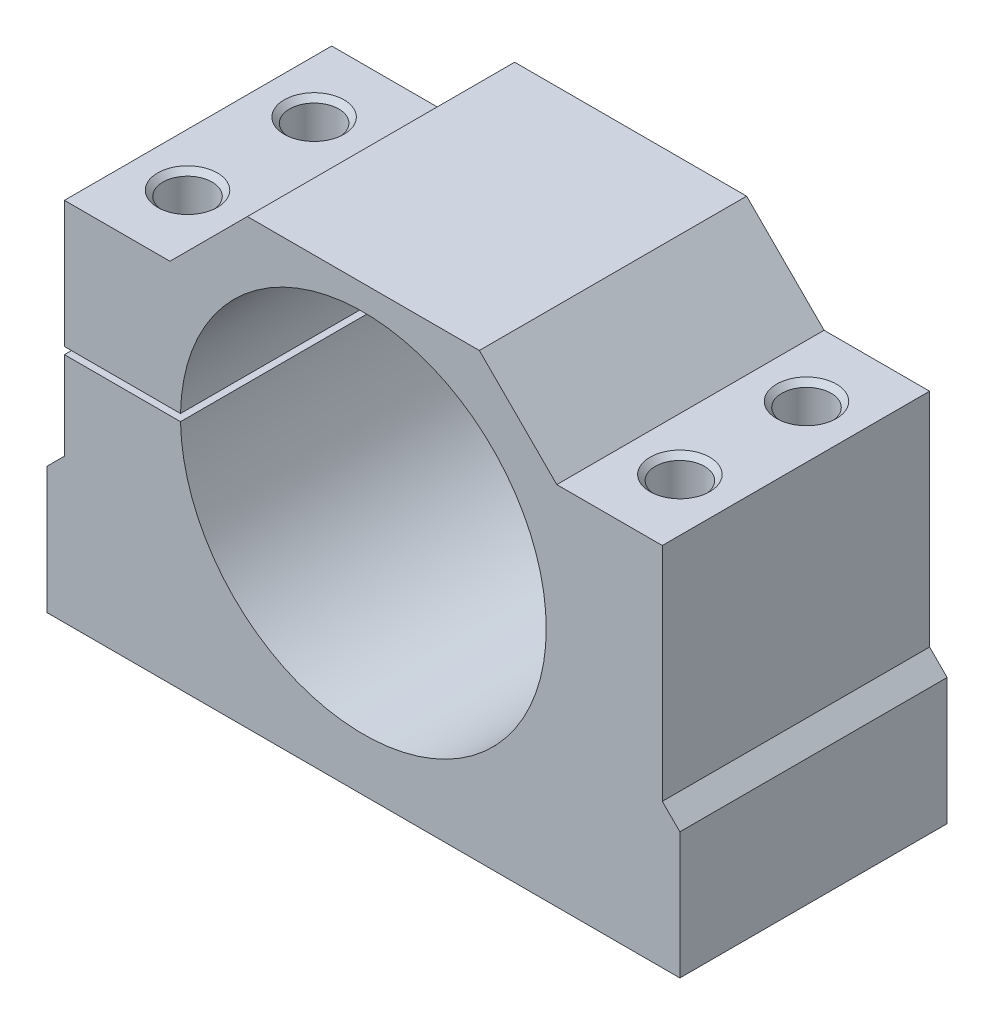
ISO-10303-21;
HEADER;
FILE_DESCRIPTION(('STEP AP214'),'2;1');
FILE_NAME('part.step','',(''),(''),'','','');
FILE_SCHEMA(('AUTOMOTIVE_DESIGN { 1 0 10303 214 1 1 1 1 }'));
ENDSEC;
DATA;
#1=APPLICATION_CONTEXT('core data for automotive mechanical design processes');
#2=APPLICATION_PROTOCOL_DEFINITION('international standard','automotive_design',2000,#1);
#3=PRODUCT_CONTEXT('',#1,'mechanical');
#4=PRODUCT('Part','Part','',(#3));
#5=PRODUCT_RELATED_PRODUCT_CATEGORY('part','',(#4));
#6=PRODUCT_DEFINITION_FORMATION('','',#4);
#7=PRODUCT_DEFINITION_CONTEXT('part definition',#1,'design');
#8=PRODUCT_DEFINITION('design','',#6,#7);
#9=PRODUCT_DEFINITION_SHAPE('','',#8);
#10=(LENGTH_UNIT() NAMED_UNIT(*) SI_UNIT(.MILLI.,.METRE.));
#11=(NAMED_UNIT(*) PLANE_ANGLE_UNIT() SI_UNIT($,.RADIAN.));
#12=(NAMED_UNIT(*) SI_UNIT($,.STERADIAN.) SOLID_ANGLE_UNIT());
#13=UNCERTAINTY_MEASURE_WITH_UNIT(LENGTH_MEASURE(1.E-05),#10,'distance_accuracy_value','');
#14=(GEOMETRIC_REPRESENTATION_CONTEXT(3) GLOBAL_UNCERTAINTY_ASSIGNED_CONTEXT((#13)) GLOBAL_UNIT_ASSIGNED_CONTEXT((#10,
#11,#12)) REPRESENTATION_CONTEXT('',''));
#15=CARTESIAN_POINT('',(0.,0.,0.));
#16=DIRECTION('',(0.,0.,1.));
#17=DIRECTION('',(1.,0.,0.));
#18=AXIS2_PLACEMENT_3D('',#15,#16,#17);
#19=CARTESIAN_POINT('',(2.5,20.5,38.));
#20=DIRECTION('',(1.,0.,0.));
#21=DIRECTION('',(0.,0.,-1.));
#22=AXIS2_PLACEMENT_3D('',#19,#20,#21);
#23=PLANE('',#22);
#24=DIRECTION('',(0.,-1.,0.));
#25=VECTOR('',#24,1.);
#26=CARTESIAN_POINT('',(2.5,20.5,0.));
#27=LINE('',#26,#25);
#28=CARTESIAN_POINT('',(2.5,52.,0.));
#29=VERTEX_POINT('',#28);
#30=CARTESIAN_POINT('',(2.5,34.,0.));
#31=VERTEX_POINT('',#30);
#32=EDGE_CURVE('E166',#29,#31,#27,.T.);
#33=ORIENTED_EDGE('',*,*,#32,.T.);
#34=DIRECTION('',(0.,0.,1.));
#35=VECTOR('',#34,1.);
#36=CARTESIAN_POINT('',(2.5,34.,0.));
#37=LINE('',#36,#35);
#38=CARTESIAN_POINT('',(2.5,34.,38.));
#39=VERTEX_POINT('',#38);
#40=EDGE_CURVE('E160',#31,#39,#37,.T.);
#41=ORIENTED_EDGE('',*,*,#40,.T.);
#42=DIRECTION('',(0.,-1.,0.));
#43=VECTOR('',#42,1.);
#44=CARTESIAN_POINT('',(2.5,20.5,38.));
#45=LINE('',#44,#43);
#46=CARTESIAN_POINT('',(2.5,52.,38.));
#47=VERTEX_POINT('',#46);
#48=EDGE_CURVE('E248',#47,#39,#45,.T.);
#49=ORIENTED_EDGE('',*,*,#48,.F.);
#50=DIRECTION('',(0.,0.,-1.));
#51=VECTOR('',#50,1.);
#52=CARTESIAN_POINT('',(2.5,52.,38.));
#53=LINE('',#52,#51);
#54=EDGE_CURVE('E187',#47,#29,#53,.T.);
#55=ORIENTED_EDGE('',*,*,#54,.T.);
#56=EDGE_LOOP('',(#33,#41,#49,#55));
#57=FACE_BOUND('',#56,.T.);
#58=ADVANCED_FACE('F32',(#57),#23,.F.);
#59=CARTESIAN_POINT('',(90.,0.,38.));
#60=DIRECTION('',(0.,1.,0.));
#61=DIRECTION('',(0.,0.,1.));
#62=AXIS2_PLACEMENT_3D('',#59,#60,#61);
#63=PLANE('',#62);
#64=CARTESIAN_POINT('',(10.,0.,10.));
#65=DIRECTION('',(0.,1.,0.));
#66=DIRECTION('',(0.,0.,1.));
#67=AXIS2_PLACEMENT_3D('',#64,#65,#66);
#68=CIRCLE('',#67,3.49999999999999);
#69=CARTESIAN_POINT('',(10.,0.,13.5));
#70=VERTEX_POINT('',#69);
#71=EDGE_CURVE('E560',#70,#70,#68,.T.);
#72=ORIENTED_EDGE('',*,*,#71,.T.);
#73=EDGE_LOOP('',(#72));
#74=FACE_BOUND('',#73,.T.);
#75=CARTESIAN_POINT('',(10.,0.,28.));
#76=DIRECTION('',(0.,1.,0.));
#77=DIRECTION('',(0.,0.,1.));
#78=AXIS2_PLACEMENT_3D('',#75,#76,#77);
#79=CIRCLE('',#78,3.49999999999999);
#80=CARTESIAN_POINT('',(10.,0.,31.5));
#81=VERTEX_POINT('',#80);
#82=EDGE_CURVE('E575',#81,#81,#79,.T.);
#83=ORIENTED_EDGE('',*,*,#82,.T.);
#84=EDGE_LOOP('',(#83));
#85=FACE_BOUND('',#84,.T.);
#86=CARTESIAN_POINT('',(80.,0.,28.));
#87=DIRECTION('',(0.,1.,0.));
#88=DIRECTION('',(0.,0.,1.));
#89=AXIS2_PLACEMENT_3D('',#86,#87,#88);
#90=CIRCLE('',#89,3.49999999999999);
#91=CARTESIAN_POINT('',(80.,0.,31.5));
#92=VERTEX_POINT('',#91);
#93=EDGE_CURVE('E590',#92,#92,#90,.T.);
#94=ORIENTED_EDGE('',*,*,#93,.T.);
#95=EDGE_LOOP('',(#94));
#96=FACE_BOUND('',#95,.T.);
#97=CARTESIAN_POINT('',(80.,0.,10.));
#98=DIRECTION('',(0.,1.,0.));
#99=DIRECTION('',(0.,0.,1.));
#100=AXIS2_PLACEMENT_3D('',#97,#98,#99);
#101=CIRCLE('',#100,3.49999999999999);
#102=CARTESIAN_POINT('',(80.,0.,13.5));
#103=VERTEX_POINT('',#102);
#104=EDGE_CURVE('E599',#103,#103,#101,.T.);
#105=ORIENTED_EDGE('',*,*,#104,.T.);
#106=EDGE_LOOP('',(#105));
#107=FACE_BOUND('',#106,.T.);
#108=DIRECTION('',(1.,0.,0.));
#109=VECTOR('',#108,1.);
#110=CARTESIAN_POINT('',(90.,0.,0.));
#111=LINE('',#110,#109);
#112=CARTESIAN_POINT('',(0.,0.,0.));
#113=VERTEX_POINT('',#112);
#114=CARTESIAN_POINT('',(90.,0.,0.));
#115=VERTEX_POINT('',#114);
#116=EDGE_CURVE('E225',#113,#115,#111,.T.);
#117=ORIENTED_EDGE('',*,*,#116,.T.);
#118=DIRECTION('',(0.,0.,-1.));
#119=VECTOR('',#118,1.);
#120=CARTESIAN_POINT('',(90.,0.,38.));
#121=LINE('',#120,#119);
#122=CARTESIAN_POINT('',(90.,0.,38.));
#123=VERTEX_POINT('',#122);
#124=EDGE_CURVE('E211',#123,#115,#121,.T.);
#125=ORIENTED_EDGE('',*,*,#124,.F.);
#126=DIRECTION('',(1.,0.,0.));
#127=VECTOR('',#126,1.);
#128=CARTESIAN_POINT('',(90.,0.,38.));
#129=LINE('',#128,#127);
#130=CARTESIAN_POINT('',(0.,0.,38.));
#131=VERTEX_POINT('',#130);
#132=EDGE_CURVE('E177',#131,#123,#129,.T.);
#133=ORIENTED_EDGE('',*,*,#132,.F.);
#134=DIRECTION('',(0.,0.,-1.));
#135=VECTOR('',#134,1.);
#136=CARTESIAN_POINT('',(0.,0.,38.));
#137=LINE('',#136,#135);
#138=EDGE_CURVE('E178',#131,#113,#137,.T.);
#139=ORIENTED_EDGE('',*,*,#138,.T.);
#140=EDGE_LOOP('',(#117,#125,#133,#139));
#141=FACE_BOUND('',#140,.T.);
#142=ADVANCED_FACE('F34',(#74,#85,#96,#107,#141),#63,.F.);
#143=CARTESIAN_POINT('',(90.,18.,38.));
#144=DIRECTION('',(-1.,0.,0.));
#145=DIRECTION('',(0.,0.,1.));
#146=AXIS2_PLACEMENT_3D('',#143,#144,#145);
#147=PLANE('',#146);
#148=DIRECTION('',(0.,1.,0.));
#149=VECTOR('',#148,1.);
#150=CARTESIAN_POINT('',(90.,18.,0.));
#151=LINE('',#150,#149);
#152=CARTESIAN_POINT('',(90.,18.,0.));
#153=VERTEX_POINT('',#152);
#154=EDGE_CURVE('E255',#115,#153,#151,.T.);
#155=ORIENTED_EDGE('',*,*,#154,.T.);
#156=DIRECTION('',(0.,0.,-1.));
#157=VECTOR('',#156,1.);
#158=CARTESIAN_POINT('',(90.,18.,38.));
#159=LINE('',#158,#157);
#160=CARTESIAN_POINT('',(90.,18.,38.));
#161=VERTEX_POINT('',#160);
#162=EDGE_CURVE('E208',#161,#153,#159,.T.);
#163=ORIENTED_EDGE('',*,*,#162,.F.);
#164=DIRECTION('',(0.,1.,0.));
#165=VECTOR('',#164,1.);
#166=CARTESIAN_POINT('',(90.,18.,38.));
#167=LINE('',#166,#165);
#168=EDGE_CURVE('E232',#123,#161,#167,.T.);
#169=ORIENTED_EDGE('',*,*,#168,.F.);
#170=ORIENTED_EDGE('',*,*,#124,.T.);
#171=EDGE_LOOP('',(#155,#163,#169,#170));
#172=FACE_BOUND('',#171,.T.);
#173=ADVANCED_FACE('F307',(#172),#147,.F.);
#174=CARTESIAN_POINT('',(87.5,20.5,38.));
#175=DIRECTION('',(-0.707106781186546,-0.707106781186549,0.));
#176=DIRECTION('',(0.707106781186549,-0.707106781186546,0.));
#177=AXIS2_PLACEMENT_3D('',#174,#175,#176);
#178=PLANE('',#177);
#179=DIRECTION('',(-0.707106781186549,0.707106781186546,0.));
#180=VECTOR('',#179,1.);
#181=CARTESIAN_POINT('',(87.5,20.5,0.));
#182=LINE('',#181,#180);
#183=CARTESIAN_POINT('',(87.5,20.5,0.));
#184=VERTEX_POINT('',#183);
#185=EDGE_CURVE('E257',#153,#184,#182,.T.);
#186=ORIENTED_EDGE('',*,*,#185,.T.);
#187=DIRECTION('',(0.,0.,-1.));
#188=VECTOR('',#187,1.);
#189=CARTESIAN_POINT('',(87.5,20.5,38.));
#190=LINE('',#189,#188);
#191=CARTESIAN_POINT('',(87.5,20.5,38.));
#192=VERTEX_POINT('',#191);
#193=EDGE_CURVE('E205',#192,#184,#190,.T.);
#194=ORIENTED_EDGE('',*,*,#193,.F.);
#195=DIRECTION('',(-0.707106781186549,0.707106781186546,0.));
#196=VECTOR('',#195,1.);
#197=CARTESIAN_POINT('',(87.5,20.5,38.));
#198=LINE('',#197,#196);
#199=EDGE_CURVE('E234',#161,#192,#198,.T.);
#200=ORIENTED_EDGE('',*,*,#199,.F.);
#201=ORIENTED_EDGE('',*,*,#162,.T.);
#202=EDGE_LOOP('',(#186,#194,#200,#201));
#203=FACE_BOUND('',#202,.T.);
#204=ADVANCED_FACE('F303',(#203),#178,.F.);
#205=CARTESIAN_POINT('',(87.5,52.,38.));
#206=DIRECTION('',(-1.,0.,0.));
#207=DIRECTION('',(0.,0.,1.));
#208=AXIS2_PLACEMENT_3D('',#205,#206,#207);
#209=PLANE('',#208);
#210=DIRECTION('',(0.,1.,0.));
#211=VECTOR('',#210,1.);
#212=CARTESIAN_POINT('',(87.5,52.,0.));
#213=LINE('',#212,#211);
#214=CARTESIAN_POINT('',(87.5,52.,0.));
#215=VERTEX_POINT('',#214);
#216=EDGE_CURVE('E259',#184,#215,#213,.T.);
#217=ORIENTED_EDGE('',*,*,#216,.T.);
#218=DIRECTION('',(0.,0.,-1.));
#219=VECTOR('',#218,1.);
#220=CARTESIAN_POINT('',(87.5,52.,38.));
#221=LINE('',#220,#219);
#222=CARTESIAN_POINT('',(87.5,52.,38.));
#223=VERTEX_POINT('',#222);
#224=EDGE_CURVE('E202',#223,#215,#221,.T.);
#225=ORIENTED_EDGE('',*,*,#224,.F.);
#226=DIRECTION('',(0.,1.,0.));
#227=VECTOR('',#226,1.);
#228=CARTESIAN_POINT('',(87.5,52.,38.));
#229=LINE('',#228,#227);
#230=EDGE_CURVE('E236',#192,#223,#229,.T.);
#231=ORIENTED_EDGE('',*,*,#230,.F.);
#232=ORIENTED_EDGE('',*,*,#193,.T.);
#233=EDGE_LOOP('',(#217,#225,#231,#232));
#234=FACE_BOUND('',#233,.T.);
#235=ADVANCED_FACE('F298',(#234),#209,.F.);
#236=CARTESIAN_POINT('',(72.5,52.,38.));
#237=DIRECTION('',(0.,-1.,0.));
#238=DIRECTION('',(1.,0.,0.));
#239=AXIS2_PLACEMENT_3D('',#236,#237,#238);
#240=PLANE('',#239);
#241=CARTESIAN_POINT('',(80.,52.,28.));
#242=DIRECTION('',(0.,1.,0.));
#243=DIRECTION('',(0.,0.,1.));
#244=AXIS2_PLACEMENT_3D('',#241,#242,#243);
#245=CIRCLE('',#244,4.25);
#246=CARTESIAN_POINT('',(80.,52.,32.25));
#247=VERTEX_POINT('',#246);
#248=EDGE_CURVE('E584',#247,#247,#245,.T.);
#249=ORIENTED_EDGE('',*,*,#248,.F.);
#250=EDGE_LOOP('',(#249));
#251=FACE_BOUND('',#250,.T.);
#252=CARTESIAN_POINT('',(80.,52.,10.));
#253=DIRECTION('',(0.,1.,0.));
#254=DIRECTION('',(0.,0.,1.));
#255=AXIS2_PLACEMENT_3D('',#252,#253,#254);
#256=CIRCLE('',#255,4.25);
#257=CARTESIAN_POINT('',(80.,52.,14.25));
#258=VERTEX_POINT('',#257);
#259=EDGE_CURVE('E593',#258,#258,#256,.T.);
#260=ORIENTED_EDGE('',*,*,#259,.F.);
#261=EDGE_LOOP('',(#260));
#262=FACE_BOUND('',#261,.T.);
#263=DIRECTION('',(-1.,0.,0.));
#264=VECTOR('',#263,1.);
#265=CARTESIAN_POINT('',(72.5,52.,0.));
#266=LINE('',#265,#264);
#267=CARTESIAN_POINT('',(72.5,52.,0.));
#268=VERTEX_POINT('',#267);
#269=EDGE_CURVE('E261',#215,#268,#266,.T.);
#270=ORIENTED_EDGE('',*,*,#269,.T.);
#271=DIRECTION('',(0.,0.,-1.));
#272=VECTOR('',#271,1.);
#273=CARTESIAN_POINT('',(72.5,52.,38.));
#274=LINE('',#273,#272);
#275=CARTESIAN_POINT('',(72.5,52.,38.));
#276=VERTEX_POINT('',#275);
#277=EDGE_CURVE('E199',#276,#268,#274,.T.);
#278=ORIENTED_EDGE('',*,*,#277,.F.);
#279=DIRECTION('',(-1.,0.,0.));
#280=VECTOR('',#279,1.);
#281=CARTESIAN_POINT('',(72.5,52.,38.));
#282=LINE('',#281,#280);
#283=EDGE_CURVE('E238',#223,#276,#282,.T.);
#284=ORIENTED_EDGE('',*,*,#283,.F.);
#285=ORIENTED_EDGE('',*,*,#224,.T.);
#286=EDGE_LOOP('',(#270,#278,#284,#285));
#287=FACE_BOUND('',#286,.T.);
#288=ADVANCED_FACE('F294',(#251,#262,#287),#240,.F.);
#289=CARTESIAN_POINT('',(61.49,63.01,38.));
#290=DIRECTION('',(-0.707106781186547,-0.707106781186549,0.));
#291=DIRECTION('',(0.707106781186549,-0.707106781186547,0.));
#292=AXIS2_PLACEMENT_3D('',#289,#290,#291);
#293=PLANE('',#292);
#294=DIRECTION('',(-0.707106781186548,0.707106781186547,0.));
#295=VECTOR('',#294,1.);
#296=CARTESIAN_POINT('',(61.49,63.01,0.));
#297=LINE('',#296,#295);
#298=CARTESIAN_POINT('',(61.49,63.01,0.));
#299=VERTEX_POINT('',#298);
#300=EDGE_CURVE('E263',#268,#299,#297,.T.);
#301=ORIENTED_EDGE('',*,*,#300,.T.);
#302=DIRECTION('',(0.,0.,-1.));
#303=VECTOR('',#302,1.);
#304=CARTESIAN_POINT('',(61.49,63.01,38.));
#305=LINE('',#304,#303);
#306=CARTESIAN_POINT('',(61.49,63.01,38.));
#307=VERTEX_POINT('',#306);
#308=EDGE_CURVE('E196',#307,#299,#305,.T.);
#309=ORIENTED_EDGE('',*,*,#308,.F.);
#310=DIRECTION('',(-0.707106781186548,0.707106781186547,0.));
#311=VECTOR('',#310,1.);
#312=CARTESIAN_POINT('',(61.49,63.01,38.));
#313=LINE('',#312,#311);
#314=EDGE_CURVE('E240',#276,#307,#313,.T.);
#315=ORIENTED_EDGE('',*,*,#314,.F.);
#316=ORIENTED_EDGE('',*,*,#277,.T.);
#317=EDGE_LOOP('',(#301,#309,#315,#316));
#318=FACE_BOUND('',#317,.T.);
#319=ADVANCED_FACE('F290',(#318),#293,.F.);
#320=CARTESIAN_POINT('',(28.5099999999999,63.01,38.));
#321=DIRECTION('',(0.,-1.,0.));
#322=DIRECTION('',(0.,0.,-1.));
#323=AXIS2_PLACEMENT_3D('',#320,#321,#322);
#324=PLANE('',#323);
#325=DIRECTION('',(-1.,0.,0.));
#326=VECTOR('',#325,1.);
#327=CARTESIAN_POINT('',(28.5099999999999,63.01,0.));
#328=LINE('',#327,#326);
#329=CARTESIAN_POINT('',(28.5099999999999,63.01,0.));
#330=VERTEX_POINT('',#329);
#331=EDGE_CURVE('E265',#299,#330,#328,.T.);
#332=ORIENTED_EDGE('',*,*,#331,.T.);
#333=DIRECTION('',(0.,0.,-1.));
#334=VECTOR('',#333,1.);
#335=CARTESIAN_POINT('',(28.5099999999999,63.01,38.));
#336=LINE('',#335,#334);
#337=CARTESIAN_POINT('',(28.5099999999999,63.01,38.));
#338=VERTEX_POINT('',#337);
#339=EDGE_CURVE('E193',#338,#330,#336,.T.);
#340=ORIENTED_EDGE('',*,*,#339,.F.);
#341=DIRECTION('',(-1.,0.,0.));
#342=VECTOR('',#341,1.);
#343=CARTESIAN_POINT('',(28.5099999999999,63.01,38.));
#344=LINE('',#343,#342);
#345=EDGE_CURVE('E242',#307,#338,#344,.T.);
#346=ORIENTED_EDGE('',*,*,#345,.F.);
#347=ORIENTED_EDGE('',*,*,#308,.T.);
#348=EDGE_LOOP('',(#332,#340,#346,#347));
#349=FACE_BOUND('',#348,.T.);
#350=ADVANCED_FACE('F285',(#349),#324,.F.);
#351=CARTESIAN_POINT('',(17.5,52.,38.));
#352=DIRECTION('',(0.707106781186549,-0.707106781186546,0.));
#353=DIRECTION('',(0.707106781186546,0.707106781186549,0.));
#354=AXIS2_PLACEMENT_3D('',#351,#352,#353);
#355=PLANE('',#354);
#356=DIRECTION('',(-0.707106781186546,-0.707106781186549,0.));
#357=VECTOR('',#356,1.);
#358=CARTESIAN_POINT('',(17.5,52.,0.));
#359=LINE('',#358,#357);
#360=CARTESIAN_POINT('',(17.5,52.,0.));
#361=VERTEX_POINT('',#360);
#362=EDGE_CURVE('E170',#330,#361,#359,.T.);
#363=ORIENTED_EDGE('',*,*,#362,.T.);
#364=DIRECTION('',(0.,0.,-1.));
#365=VECTOR('',#364,1.);
#366=CARTESIAN_POINT('',(17.5,52.,38.));
#367=LINE('',#366,#365);
#368=CARTESIAN_POINT('',(17.5,52.,38.));
#369=VERTEX_POINT('',#368);
#370=EDGE_CURVE('E190',#369,#361,#367,.T.);
#371=ORIENTED_EDGE('',*,*,#370,.F.);
#372=DIRECTION('',(-0.707106781186546,-0.707106781186549,0.));
#373=VECTOR('',#372,1.);
#374=CARTESIAN_POINT('',(17.5,52.,38.));
#375=LINE('',#374,#373);
#376=EDGE_CURVE('E244',#338,#369,#375,.T.);
#377=ORIENTED_EDGE('',*,*,#376,.F.);
#378=ORIENTED_EDGE('',*,*,#339,.T.);
#379=EDGE_LOOP('',(#363,#371,#377,#378));
#380=FACE_BOUND('',#379,.T.);
#381=ADVANCED_FACE('F269',(#380),#355,.F.);
#382=CARTESIAN_POINT('',(2.5,52.,38.));
#383=DIRECTION('',(0.,-1.,0.));
#384=DIRECTION('',(1.,0.,0.));
#385=AXIS2_PLACEMENT_3D('',#382,#383,#384);
#386=PLANE('',#385);
#387=CARTESIAN_POINT('',(10.,52.,10.));
#388=DIRECTION('',(0.,1.,0.));
#389=DIRECTION('',(0.,0.,1.));
#390=AXIS2_PLACEMENT_3D('',#387,#388,#389);
#391=CIRCLE('',#390,4.25);
#392=CARTESIAN_POINT('',(10.,52.,14.25));
#393=VERTEX_POINT('',#392);
#394=EDGE_CURVE('E632',#393,#393,#391,.T.);
#395=ORIENTED_EDGE('',*,*,#394,.F.);
#396=EDGE_LOOP('',(#395));
#397=FACE_BOUND('',#396,.T.);
#398=CARTESIAN_POINT('',(10.,52.,28.));
#399=DIRECTION('',(0.,1.,0.));
#400=DIRECTION('',(0.,0.,1.));
#401=AXIS2_PLACEMENT_3D('',#398,#399,#400);
#402=CIRCLE('',#401,4.25);
#403=CARTESIAN_POINT('',(10.,52.,32.25));
#404=VERTEX_POINT('',#403);
#405=EDGE_CURVE('E564',#404,#404,#402,.T.);
#406=ORIENTED_EDGE('',*,*,#405,.F.);
#407=EDGE_LOOP('',(#406));
#408=FACE_BOUND('',#407,.T.);
#409=DIRECTION('',(-1.,0.,0.));
#410=VECTOR('',#409,1.);
#411=CARTESIAN_POINT('',(2.5,52.,0.));
#412=LINE('',#411,#410);
#413=EDGE_CURVE('E167',#361,#29,#412,.T.);
#414=ORIENTED_EDGE('',*,*,#413,.T.);
#415=ORIENTED_EDGE('',*,*,#54,.F.);
#416=DIRECTION('',(-1.,0.,0.));
#417=VECTOR('',#416,1.);
#418=CARTESIAN_POINT('',(2.5,52.,38.));
#419=LINE('',#418,#417);
#420=EDGE_CURVE('E246',#369,#47,#419,.T.);
#421=ORIENTED_EDGE('',*,*,#420,.F.);
#422=ORIENTED_EDGE('',*,*,#370,.T.);
#423=EDGE_LOOP('',(#414,#415,#421,#422));
#424=FACE_BOUND('',#423,.T.);
#425=ADVANCED_FACE('F276',(#397,#408,#424),#386,.F.);
#426=CARTESIAN_POINT('',(2.5,33.,38.));
#427=VERTEX_POINT('',#426);
#428=CARTESIAN_POINT('',(2.5,20.5,38.));
#429=VERTEX_POINT('',#428);
#430=EDGE_CURVE('E159',#427,#429,#45,.T.);
#431=ORIENTED_EDGE('',*,*,#430,.F.);
#432=DIRECTION('',(0.,0.,1.));
#433=VECTOR('',#432,1.);
#434=CARTESIAN_POINT('',(2.5,33.,0.));
#435=LINE('',#434,#433);
#436=CARTESIAN_POINT('',(2.5,33.,0.));
#437=VERTEX_POINT('',#436);
#438=EDGE_CURVE('E146',#437,#427,#435,.T.);
#439=ORIENTED_EDGE('',*,*,#438,.F.);
#440=CARTESIAN_POINT('',(2.5,20.5,0.));
#441=VERTEX_POINT('',#440);
#442=EDGE_CURVE('E157',#437,#441,#27,.T.);
#443=ORIENTED_EDGE('',*,*,#442,.T.);
#444=DIRECTION('',(0.,0.,-1.));
#445=VECTOR('',#444,1.);
#446=CARTESIAN_POINT('',(2.5,20.5,38.));
#447=LINE('',#446,#445);
#448=EDGE_CURVE('E185',#429,#441,#447,.T.);
#449=ORIENTED_EDGE('',*,*,#448,.F.);
#450=EDGE_LOOP('',(#431,#439,#443,#449));
#451=FACE_BOUND('',#450,.T.);
#452=ADVANCED_FACE('F155',(#451),#23,.F.);
#453=CARTESIAN_POINT('',(0.,18.,38.));
#454=DIRECTION('',(0.707106781186549,-0.707106781186546,0.));
#455=DIRECTION('',(0.707106781186546,0.707106781186549,0.));
#456=AXIS2_PLACEMENT_3D('',#453,#454,#455);
#457=PLANE('',#456);
#458=DIRECTION('',(-0.707106781186546,-0.707106781186549,0.));
#459=VECTOR('',#458,1.);
#460=CARTESIAN_POINT('',(0.,18.,0.));
#461=LINE('',#460,#459);
#462=CARTESIAN_POINT('',(0.,18.,0.));
#463=VERTEX_POINT('',#462);
#464=EDGE_CURVE('E165',#441,#463,#461,.T.);
#465=ORIENTED_EDGE('',*,*,#464,.T.);
#466=DIRECTION('',(0.,0.,-1.));
#467=VECTOR('',#466,1.);
#468=CARTESIAN_POINT('',(0.,18.,38.));
#469=LINE('',#468,#467);
#470=CARTESIAN_POINT('',(0.,18.,38.));
#471=VERTEX_POINT('',#470);
#472=EDGE_CURVE('E181',#471,#463,#469,.T.);
#473=ORIENTED_EDGE('',*,*,#472,.F.);
#474=DIRECTION('',(-0.707106781186546,-0.707106781186549,0.));
#475=VECTOR('',#474,1.);
#476=CARTESIAN_POINT('',(0.,18.,38.));
#477=LINE('',#476,#475);
#478=EDGE_CURVE('E250',#429,#471,#477,.T.);
#479=ORIENTED_EDGE('',*,*,#478,.F.);
#480=ORIENTED_EDGE('',*,*,#448,.T.);
#481=EDGE_LOOP('',(#465,#473,#479,#480));
#482=FACE_BOUND('',#481,.T.);
#483=ADVANCED_FACE('F318',(#482),#457,.F.);
#484=CARTESIAN_POINT('',(0.,0.,38.));
#485=DIRECTION('',(1.,0.,0.));
#486=DIRECTION('',(0.,0.,-1.));
#487=AXIS2_PLACEMENT_3D('',#484,#485,#486);
#488=PLANE('',#487);
#489=DIRECTION('',(0.,-1.,0.));
#490=VECTOR('',#489,1.);
#491=CARTESIAN_POINT('',(0.,0.,0.));
#492=LINE('',#491,#490);
#493=EDGE_CURVE('E175',#463,#113,#492,.T.);
#494=ORIENTED_EDGE('',*,*,#493,.T.);
#495=ORIENTED_EDGE('',*,*,#138,.F.);
#496=DIRECTION('',(0.,-1.,0.));
#497=VECTOR('',#496,1.);
#498=CARTESIAN_POINT('',(0.,0.,38.));
#499=LINE('',#498,#497);
#500=EDGE_CURVE('E182',#471,#131,#499,.T.);
#501=ORIENTED_EDGE('',*,*,#500,.F.);
#502=ORIENTED_EDGE('',*,*,#472,.T.);
#503=EDGE_LOOP('',(#494,#495,#501,#502));
#504=FACE_BOUND('',#503,.T.);
#505=ADVANCED_FACE('F313',(#504),#488,.F.);
#506=CARTESIAN_POINT('',(0.,0.,38.));
#507=DIRECTION('',(0.,0.,-1.));
#508=DIRECTION('',(-1.,0.,0.));
#509=AXIS2_PLACEMENT_3D('',#506,#507,#508);
#510=PLANE('',#509);
#511=ORIENTED_EDGE('',*,*,#48,.T.);
#512=DIRECTION('',(-1.,0.,0.));
#513=VECTOR('',#512,1.);
#514=CARTESIAN_POINT('',(2.5,34.,38.));
#515=LINE('',#514,#513);
#516=CARTESIAN_POINT('',(19.0048081368881,34.,38.));
#517=VERTEX_POINT('',#516);
#518=EDGE_CURVE('E151',#517,#39,#515,.T.);
#519=ORIENTED_EDGE('',*,*,#518,.F.);
#520=CARTESIAN_POINT('',(45.,33.5,38.));
#521=DIRECTION('',(0.,0.,1.));
#522=DIRECTION('',(1.,0.,0.));
#523=AXIS2_PLACEMENT_3D('',#520,#521,#522);
#524=CIRCLE('',#523,26.);
#525=CARTESIAN_POINT('',(19.0048081368881,33.,38.));
#526=VERTEX_POINT('',#525);
#527=EDGE_CURVE('E218',#526,#517,#524,.T.);
#528=ORIENTED_EDGE('',*,*,#527,.F.);
#529=DIRECTION('',(1.,0.,0.));
#530=VECTOR('',#529,1.);
#531=CARTESIAN_POINT('',(19.5,33.,38.));
#532=LINE('',#531,#530);
#533=EDGE_CURVE('E48',#427,#526,#532,.T.);
#534=ORIENTED_EDGE('',*,*,#533,.F.);
#535=ORIENTED_EDGE('',*,*,#430,.T.);
#536=ORIENTED_EDGE('',*,*,#478,.T.);
#537=ORIENTED_EDGE('',*,*,#500,.T.);
#538=ORIENTED_EDGE('',*,*,#132,.T.);
#539=ORIENTED_EDGE('',*,*,#168,.T.);
#540=ORIENTED_EDGE('',*,*,#199,.T.);
#541=ORIENTED_EDGE('',*,*,#230,.T.);
#542=ORIENTED_EDGE('',*,*,#283,.T.);
#543=ORIENTED_EDGE('',*,*,#314,.T.);
#544=ORIENTED_EDGE('',*,*,#345,.T.);
#545=ORIENTED_EDGE('',*,*,#376,.T.);
#546=ORIENTED_EDGE('',*,*,#420,.T.);
#547=EDGE_LOOP('',(#511,#519,#528,#534,#535,#536,#537,#538,#539,#540,#541,#542,#543,#544,#545,#546));
#548=FACE_BOUND('',#547,.T.);
#549=ADVANCED_FACE('F223',(#548),#510,.F.);
#550=CARTESIAN_POINT('',(0.,0.,0.));
#551=DIRECTION('',(0.,0.,-1.));
#552=DIRECTION('',(-1.,0.,0.));
#553=AXIS2_PLACEMENT_3D('',#550,#551,#552);
#554=PLANE('',#553);
#555=DIRECTION('',(-1.,0.,0.));
#556=VECTOR('',#555,1.);
#557=CARTESIAN_POINT('',(2.5,34.,0.));
#558=LINE('',#557,#556);
#559=CARTESIAN_POINT('',(19.0048081368881,34.,0.));
#560=VERTEX_POINT('',#559);
#561=EDGE_CURVE('E56',#560,#31,#558,.T.);
#562=ORIENTED_EDGE('',*,*,#561,.T.);
#563=ORIENTED_EDGE('',*,*,#32,.F.);
#564=ORIENTED_EDGE('',*,*,#413,.F.);
#565=ORIENTED_EDGE('',*,*,#362,.F.);
#566=ORIENTED_EDGE('',*,*,#331,.F.);
#567=ORIENTED_EDGE('',*,*,#300,.F.);
#568=ORIENTED_EDGE('',*,*,#269,.F.);
#569=ORIENTED_EDGE('',*,*,#216,.F.);
#570=ORIENTED_EDGE('',*,*,#185,.F.);
#571=ORIENTED_EDGE('',*,*,#154,.F.);
#572=ORIENTED_EDGE('',*,*,#116,.F.);
#573=ORIENTED_EDGE('',*,*,#493,.F.);
#574=ORIENTED_EDGE('',*,*,#464,.F.);
#575=ORIENTED_EDGE('',*,*,#442,.F.);
#576=DIRECTION('',(1.,0.,0.));
#577=VECTOR('',#576,1.);
#578=CARTESIAN_POINT('',(19.5,33.,0.));
#579=LINE('',#578,#577);
#580=CARTESIAN_POINT('',(19.0048081368881,33.,0.));
#581=VERTEX_POINT('',#580);
#582=EDGE_CURVE('E143',#437,#581,#579,.T.);
#583=ORIENTED_EDGE('',*,*,#582,.T.);
#584=CARTESIAN_POINT('',(45.,33.5,0.));
#585=DIRECTION('',(0.,0.,1.));
#586=DIRECTION('',(1.,0.,0.));
#587=AXIS2_PLACEMENT_3D('',#584,#585,#586);
#588=CIRCLE('',#587,26.);
#589=EDGE_CURVE('E219',#581,#560,#588,.T.);
#590=ORIENTED_EDGE('',*,*,#589,.T.);
#591=EDGE_LOOP('',(#562,#563,#564,#565,#566,#567,#568,#569,#570,#571,#572,#573,#574,#575,#583,#590));
#592=FACE_BOUND('',#591,.T.);
#593=ADVANCED_FACE('F163',(#592),#554,.T.);
#594=CARTESIAN_POINT('',(45.,33.5,0.));
#595=DIRECTION('',(0.,0.,1.));
#596=DIRECTION('',(1.,0.,0.));
#597=AXIS2_PLACEMENT_3D('',#594,#595,#596);
#598=CYLINDRICAL_SURFACE('',#597,26.);
#599=ORIENTED_EDGE('',*,*,#527,.T.);
#600=DIRECTION('',(0.,0.,1.));
#601=VECTOR('',#600,1.);
#602=CARTESIAN_POINT('',(19.0048081368881,34.,0.));
#603=LINE('',#602,#601);
#604=EDGE_CURVE('E11',#517,#560,#603,.F.);
#605=ORIENTED_EDGE('',*,*,#604,.T.);
#606=ORIENTED_EDGE('',*,*,#589,.F.);
#607=DIRECTION('',(0.,0.,1.));
#608=VECTOR('',#607,1.);
#609=CARTESIAN_POINT('',(19.0048081368881,33.,0.));
#610=LINE('',#609,#608);
#611=EDGE_CURVE('E41',#581,#526,#610,.T.);
#612=ORIENTED_EDGE('',*,*,#611,.T.);
#613=EDGE_LOOP('',(#599,#605,#606,#612));
#614=FACE_BOUND('',#613,.T.);
#615=ADVANCED_FACE('F217',(#614),#598,.F.);
#616=CARTESIAN_POINT('',(19.5,33.,0.));
#617=DIRECTION('',(0.,-1.,0.));
#618=DIRECTION('',(0.,0.,-1.));
#619=AXIS2_PLACEMENT_3D('',#616,#617,#618);
#620=PLANE('',#619);
#621=CARTESIAN_POINT('',(10.,33.,10.));
#622=DIRECTION('',(0.,-1.,0.));
#623=DIRECTION('',(0.,0.,-1.));
#624=AXIS2_PLACEMENT_3D('',#621,#622,#623);
#625=CIRCLE('',#624,3.5);
#626=CARTESIAN_POINT('',(10.,33.,6.5));
#627=VERTEX_POINT('',#626);
#628=EDGE_CURVE('E563',#627,#627,#625,.T.);
#629=ORIENTED_EDGE('',*,*,#628,.T.);
#630=EDGE_LOOP('',(#629));
#631=FACE_BOUND('',#630,.T.);
#632=CARTESIAN_POINT('',(10.,33.,28.));
#633=DIRECTION('',(0.,-1.,0.));
#634=DIRECTION('',(0.,0.,-1.));
#635=AXIS2_PLACEMENT_3D('',#632,#633,#634);
#636=CIRCLE('',#635,3.5);
#637=CARTESIAN_POINT('',(10.,33.,24.5));
#638=VERTEX_POINT('',#637);
#639=EDGE_CURVE('E581',#638,#638,#636,.T.);
#640=ORIENTED_EDGE('',*,*,#639,.T.);
#641=EDGE_LOOP('',(#640));
#642=FACE_BOUND('',#641,.T.);
#643=ORIENTED_EDGE('',*,*,#582,.F.);
#644=ORIENTED_EDGE('',*,*,#438,.T.);
#645=ORIENTED_EDGE('',*,*,#533,.T.);
#646=ORIENTED_EDGE('',*,*,#611,.F.);
#647=EDGE_LOOP('',(#643,#644,#645,#646));
#648=FACE_BOUND('',#647,.T.);
#649=ADVANCED_FACE('F145',(#631,#642,#648),#620,.F.);
#650=CARTESIAN_POINT('',(2.5,34.,0.));
#651=DIRECTION('',(0.,1.,0.));
#652=DIRECTION('',(0.,0.,1.));
#653=AXIS2_PLACEMENT_3D('',#650,#651,#652);
#654=PLANE('',#653);
#655=CARTESIAN_POINT('',(10.,34.,10.));
#656=DIRECTION('',(0.,1.,0.));
#657=DIRECTION('',(0.,0.,1.));
#658=AXIS2_PLACEMENT_3D('',#655,#656,#657);
#659=CIRCLE('',#658,3.5);
#660=CARTESIAN_POINT('',(10.,34.,13.5));
#661=VERTEX_POINT('',#660);
#662=EDGE_CURVE('E36',#661,#661,#659,.T.);
#663=ORIENTED_EDGE('',*,*,#662,.T.);
#664=EDGE_LOOP('',(#663));
#665=FACE_BOUND('',#664,.T.);
#666=CARTESIAN_POINT('',(10.,34.,28.));
#667=DIRECTION('',(0.,1.,0.));
#668=DIRECTION('',(0.,0.,1.));
#669=AXIS2_PLACEMENT_3D('',#666,#667,#668);
#670=CIRCLE('',#669,3.5);
#671=CARTESIAN_POINT('',(10.,34.,31.5));
#672=VERTEX_POINT('',#671);
#673=EDGE_CURVE('E578',#672,#672,#670,.T.);
#674=ORIENTED_EDGE('',*,*,#673,.T.);
#675=EDGE_LOOP('',(#674));
#676=FACE_BOUND('',#675,.T.);
#677=ORIENTED_EDGE('',*,*,#518,.T.);
#678=ORIENTED_EDGE('',*,*,#40,.F.);
#679=ORIENTED_EDGE('',*,*,#561,.F.);
#680=ORIENTED_EDGE('',*,*,#604,.F.);
#681=EDGE_LOOP('',(#677,#678,#679,#680));
#682=FACE_BOUND('',#681,.T.);
#683=ADVANCED_FACE('F442',(#665,#676,#682),#654,.F.);
#684=CARTESIAN_POINT('',(80.,52.,10.));
#685=DIRECTION('',(0.,1.,0.));
#686=DIRECTION('',(0.,0.,1.));
#687=AXIS2_PLACEMENT_3D('',#684,#685,#686);
#688=CYLINDRICAL_SURFACE('',#687,3.5);
#689=ORIENTED_EDGE('',*,*,#104,.F.);
#690=EDGE_LOOP('',(#689));
#691=FACE_BOUND('',#690,.T.);
#692=CARTESIAN_POINT('',(80.,51.25,10.));
#693=DIRECTION('',(0.,1.,0.));
#694=DIRECTION('',(0.,0.,1.));
#695=AXIS2_PLACEMENT_3D('',#692,#693,#694);
#696=CIRCLE('',#695,3.5);
#697=CARTESIAN_POINT('',(80.,51.25,13.5));
#698=VERTEX_POINT('',#697);
#699=EDGE_CURVE('E596',#698,#698,#696,.T.);
#700=ORIENTED_EDGE('',*,*,#699,.T.);
#701=EDGE_LOOP('',(#700));
#702=FACE_BOUND('',#701,.T.);
#703=ADVANCED_FACE('F450',(#691,#702),#688,.F.);
#704=CARTESIAN_POINT('',(80.,52.,10.));
#705=DIRECTION('',(0.,1.,0.));
#706=DIRECTION('',(0.,0.,1.));
#707=AXIS2_PLACEMENT_3D('',#704,#705,#706);
#708=CONICAL_SURFACE('',#707,4.25,0.785398163397448);
#709=ORIENTED_EDGE('',*,*,#699,.F.);
#710=EDGE_LOOP('',(#709));
#711=FACE_BOUND('',#710,.T.);
#712=ORIENTED_EDGE('',*,*,#259,.T.);
#713=EDGE_LOOP('',(#712));
#714=FACE_BOUND('',#713,.T.);
#715=ADVANCED_FACE('F458',(#711,#714),#708,.F.);
#716=CARTESIAN_POINT('',(80.,52.,28.));
#717=DIRECTION('',(0.,1.,0.));
#718=DIRECTION('',(0.,0.,1.));
#719=AXIS2_PLACEMENT_3D('',#716,#717,#718);
#720=CYLINDRICAL_SURFACE('',#719,3.5);
#721=ORIENTED_EDGE('',*,*,#93,.F.);
#722=EDGE_LOOP('',(#721));
#723=FACE_BOUND('',#722,.T.);
#724=CARTESIAN_POINT('',(80.,51.25,28.));
#725=DIRECTION('',(0.,1.,0.));
#726=DIRECTION('',(0.,0.,1.));
#727=AXIS2_PLACEMENT_3D('',#724,#725,#726);
#728=CIRCLE('',#727,3.5);
#729=CARTESIAN_POINT('',(80.,51.25,31.5));
#730=VERTEX_POINT('',#729);
#731=EDGE_CURVE('E587',#730,#730,#728,.T.);
#732=ORIENTED_EDGE('',*,*,#731,.T.);
#733=EDGE_LOOP('',(#732));
#734=FACE_BOUND('',#733,.T.);
#735=ADVANCED_FACE('F466',(#723,#734),#720,.F.);
#736=CARTESIAN_POINT('',(80.,52.,28.));
#737=DIRECTION('',(0.,1.,0.));
#738=DIRECTION('',(0.,0.,1.));
#739=AXIS2_PLACEMENT_3D('',#736,#737,#738);
#740=CONICAL_SURFACE('',#739,4.25,0.785398163397448);
#741=ORIENTED_EDGE('',*,*,#731,.F.);
#742=EDGE_LOOP('',(#741));
#743=FACE_BOUND('',#742,.T.);
#744=ORIENTED_EDGE('',*,*,#248,.T.);
#745=EDGE_LOOP('',(#744));
#746=FACE_BOUND('',#745,.T.);
#747=ADVANCED_FACE('F474',(#743,#746),#740,.F.);
#748=CARTESIAN_POINT('',(10.,52.,28.));
#749=DIRECTION('',(0.,1.,0.));
#750=DIRECTION('',(0.,0.,1.));
#751=AXIS2_PLACEMENT_3D('',#748,#749,#750);
#752=CYLINDRICAL_SURFACE('',#751,3.5);
#753=ORIENTED_EDGE('',*,*,#82,.F.);
#754=EDGE_LOOP('',(#753));
#755=FACE_BOUND('',#754,.T.);
#756=ORIENTED_EDGE('',*,*,#639,.F.);
#757=EDGE_LOOP('',(#756));
#758=FACE_BOUND('',#757,.T.);
#759=ADVANCED_FACE('F482',(#755,#758),#752,.F.);
#760=CARTESIAN_POINT('',(10.,51.25,28.));
#761=DIRECTION('',(0.,1.,0.));
#762=DIRECTION('',(0.,0.,1.));
#763=AXIS2_PLACEMENT_3D('',#760,#761,#762);
#764=CIRCLE('',#763,3.5);
#765=CARTESIAN_POINT('',(10.,51.25,31.5));
#766=VERTEX_POINT('',#765);
#767=EDGE_CURVE('E567',#766,#766,#764,.T.);
#768=ORIENTED_EDGE('',*,*,#767,.T.);
#769=EDGE_LOOP('',(#768));
#770=FACE_BOUND('',#769,.T.);
#771=ORIENTED_EDGE('',*,*,#673,.F.);
#772=EDGE_LOOP('',(#771));
#773=FACE_BOUND('',#772,.T.);
#774=ADVANCED_FACE('F490',(#770,#773),#752,.F.);
#775=CARTESIAN_POINT('',(10.,52.,28.));
#776=DIRECTION('',(0.,1.,0.));
#777=DIRECTION('',(0.,0.,1.));
#778=AXIS2_PLACEMENT_3D('',#775,#776,#777);
#779=CONICAL_SURFACE('',#778,4.25,0.785398163397448);
#780=ORIENTED_EDGE('',*,*,#767,.F.);
#781=EDGE_LOOP('',(#780));
#782=FACE_BOUND('',#781,.T.);
#783=ORIENTED_EDGE('',*,*,#405,.T.);
#784=EDGE_LOOP('',(#783));
#785=FACE_BOUND('',#784,.T.);
#786=ADVANCED_FACE('F498',(#782,#785),#779,.F.);
#787=CARTESIAN_POINT('',(10.,52.,10.));
#788=DIRECTION('',(0.,1.,0.));
#789=DIRECTION('',(0.,0.,1.));
#790=AXIS2_PLACEMENT_3D('',#787,#788,#789);
#791=CYLINDRICAL_SURFACE('',#790,3.5);
#792=CARTESIAN_POINT('',(10.,51.25,10.));
#793=DIRECTION('',(0.,1.,0.));
#794=DIRECTION('',(0.,0.,1.));
#795=AXIS2_PLACEMENT_3D('',#792,#793,#794);
#796=CIRCLE('',#795,3.5);
#797=CARTESIAN_POINT('',(10.,51.25,13.5));
#798=VERTEX_POINT('',#797);
#799=EDGE_CURVE('E629',#798,#798,#796,.T.);
#800=ORIENTED_EDGE('',*,*,#799,.T.);
#801=EDGE_LOOP('',(#800));
#802=FACE_BOUND('',#801,.T.);
#803=ORIENTED_EDGE('',*,*,#662,.F.);
#804=EDGE_LOOP('',(#803));
#805=FACE_BOUND('',#804,.T.);
#806=ADVANCED_FACE('F505',(#802,#805),#791,.F.);
#807=CARTESIAN_POINT('',(10.,52.,10.));
#808=DIRECTION('',(0.,1.,0.));
#809=DIRECTION('',(0.,0.,1.));
#810=AXIS2_PLACEMENT_3D('',#807,#808,#809);
#811=CONICAL_SURFACE('',#810,4.25,0.785398163397448);
#812=ORIENTED_EDGE('',*,*,#799,.F.);
#813=EDGE_LOOP('',(#812));
#814=FACE_BOUND('',#813,.T.);
#815=ORIENTED_EDGE('',*,*,#394,.T.);
#816=EDGE_LOOP('',(#815));
#817=FACE_BOUND('',#816,.T.);
#818=ADVANCED_FACE('F513',(#814,#817),#811,.F.);
#819=ORIENTED_EDGE('',*,*,#71,.F.);
#820=EDGE_LOOP('',(#819));
#821=FACE_BOUND('',#820,.T.);
#822=ORIENTED_EDGE('',*,*,#628,.F.);
#823=EDGE_LOOP('',(#822));
#824=FACE_BOUND('',#823,.T.);
#825=ADVANCED_FACE('F516',(#821,#824),#791,.F.);
#826=CLOSED_SHELL('',(#58,#142,#173,#204,#235,#288,#319,#350,#381,#425,#452,#483,#505,#549,#593,
#615,#649,#683,#703,#715,#735,#747,#759,#774,#786,#806,#818,#825));
#827=MANIFOLD_SOLID_BREP('B2',#826);
#828=ADVANCED_BREP_SHAPE_REPRESENTATION('',(#18,#827),#14);
#829=SHAPE_DEFINITION_REPRESENTATION(#9,#828);
ENDSEC;
END-ISO-10303-21;
